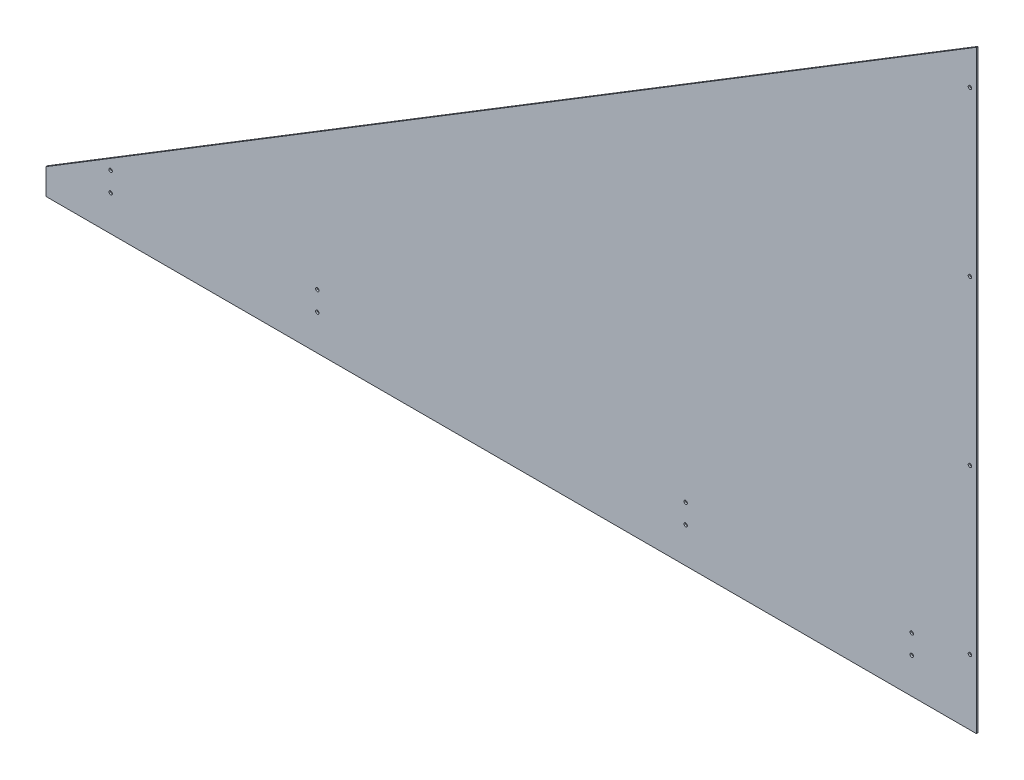
ISO-10303-21;
HEADER;
FILE_DESCRIPTION(('STEP AP214'),'2;1');
FILE_NAME('part.step','',(''),(''),'','','');
FILE_SCHEMA(('AUTOMOTIVE_DESIGN { 1 0 10303 214 1 1 1 1 }'));
ENDSEC;
DATA;
#1=APPLICATION_CONTEXT('core data for automotive mechanical design processes');
#2=APPLICATION_PROTOCOL_DEFINITION('international standard','automotive_design',2000,#1);
#3=PRODUCT_CONTEXT('',#1,'mechanical');
#4=PRODUCT('Part','Part','',(#3));
#5=PRODUCT_RELATED_PRODUCT_CATEGORY('part','',(#4));
#6=PRODUCT_DEFINITION_FORMATION('','',#4);
#7=PRODUCT_DEFINITION_CONTEXT('part definition',#1,'design');
#8=PRODUCT_DEFINITION('design','',#6,#7);
#9=PRODUCT_DEFINITION_SHAPE('','',#8);
#10=(LENGTH_UNIT() NAMED_UNIT(*) SI_UNIT(.MILLI.,.METRE.));
#11=(NAMED_UNIT(*) PLANE_ANGLE_UNIT() SI_UNIT($,.RADIAN.));
#12=(NAMED_UNIT(*) SI_UNIT($,.STERADIAN.) SOLID_ANGLE_UNIT());
#13=UNCERTAINTY_MEASURE_WITH_UNIT(LENGTH_MEASURE(1.E-05),#10,'distance_accuracy_value','');
#14=(GEOMETRIC_REPRESENTATION_CONTEXT(3) GLOBAL_UNCERTAINTY_ASSIGNED_CONTEXT((#13)) GLOBAL_UNIT_ASSIGNED_CONTEXT((#10,
#11,#12)) REPRESENTATION_CONTEXT('',''));
#15=CARTESIAN_POINT('',(0.,0.,0.));
#16=DIRECTION('',(0.,0.,1.));
#17=DIRECTION('',(1.,0.,0.));
#18=AXIS2_PLACEMENT_3D('',#15,#16,#17);
#19=CARTESIAN_POINT('',(0.,0.,3.175));
#20=DIRECTION('',(0.,0.,1.));
#21=DIRECTION('',(1.,0.,0.));
#22=AXIS2_PLACEMENT_3D('',#19,#20,#21);
#23=PLANE('',#22);
#24=CARTESIAN_POINT('',(1816.1,77.7875,3.175));
#25=DIRECTION('',(0.,0.,-1.));
#26=DIRECTION('',(-1.,0.,0.));
#27=AXIS2_PLACEMENT_3D('',#24,#25,#26);
#28=CIRCLE('',#27,3.3782);
#29=CARTESIAN_POINT('',(1812.7218,77.7875,3.175));
#30=VERTEX_POINT('',#29);
#31=EDGE_CURVE('E100',#30,#30,#28,.T.);
#32=ORIENTED_EDGE('',*,*,#31,.T.);
#33=EDGE_LOOP('',(#32));
#34=FACE_BOUND('',#33,.T.);
#35=CARTESIAN_POINT('',(1816.1,399.520833333333,3.175));
#36=DIRECTION('',(0.,0.,-1.));
#37=DIRECTION('',(-1.,0.,0.));
#38=AXIS2_PLACEMENT_3D('',#35,#36,#37);
#39=CIRCLE('',#38,3.3782);
#40=CARTESIAN_POINT('',(1812.7218,399.520833333333,3.175));
#41=VERTEX_POINT('',#40);
#42=EDGE_CURVE('E106',#41,#41,#39,.T.);
#43=ORIENTED_EDGE('',*,*,#42,.T.);
#44=EDGE_LOOP('',(#43));
#45=FACE_BOUND('',#44,.T.);
#46=CARTESIAN_POINT('',(1816.1,721.254166666667,3.175));
#47=DIRECTION('',(0.,0.,-1.));
#48=DIRECTION('',(-1.,0.,0.));
#49=AXIS2_PLACEMENT_3D('',#46,#47,#48);
#50=CIRCLE('',#49,3.3782);
#51=CARTESIAN_POINT('',(1812.7218,721.254166666667,3.175));
#52=VERTEX_POINT('',#51);
#53=EDGE_CURVE('E112',#52,#52,#50,.T.);
#54=ORIENTED_EDGE('',*,*,#53,.T.);
#55=EDGE_LOOP('',(#54));
#56=FACE_BOUND('',#55,.T.);
#57=CARTESIAN_POINT('',(1816.1,1042.9875,3.175));
#58=DIRECTION('',(0.,0.,-1.));
#59=DIRECTION('',(-1.,0.,0.));
#60=AXIS2_PLACEMENT_3D('',#57,#58,#59);
#61=CIRCLE('',#60,3.3782);
#62=CARTESIAN_POINT('',(1812.7218,1042.9875,3.175));
#63=VERTEX_POINT('',#62);
#64=EDGE_CURVE('E118',#63,#63,#61,.T.);
#65=ORIENTED_EDGE('',*,*,#64,.T.);
#66=EDGE_LOOP('',(#65));
#67=FACE_BOUND('',#66,.T.);
#68=CARTESIAN_POINT('',(1701.8,19.05,3.175));
#69=DIRECTION('',(0.,0.,-1.));
#70=DIRECTION('',(-1.,0.,0.));
#71=AXIS2_PLACEMENT_3D('',#68,#69,#70);
#72=CIRCLE('',#71,3.3782);
#73=CARTESIAN_POINT('',(1698.4218,19.05,3.175));
#74=VERTEX_POINT('',#73);
#75=EDGE_CURVE('E124',#74,#74,#72,.T.);
#76=ORIENTED_EDGE('',*,*,#75,.T.);
#77=EDGE_LOOP('',(#76));
#78=FACE_BOUND('',#77,.T.);
#79=CARTESIAN_POINT('',(1701.8,57.15,3.175));
#80=DIRECTION('',(0.,0.,-1.));
#81=DIRECTION('',(-1.,0.,0.));
#82=AXIS2_PLACEMENT_3D('',#79,#80,#81);
#83=CIRCLE('',#82,3.3782);
#84=CARTESIAN_POINT('',(1698.4218,57.15,3.175));
#85=VERTEX_POINT('',#84);
#86=EDGE_CURVE('E130',#85,#85,#83,.T.);
#87=ORIENTED_EDGE('',*,*,#86,.T.);
#88=EDGE_LOOP('',(#87));
#89=FACE_BOUND('',#88,.T.);
#90=DIRECTION('',(-0.853281833651959,-0.521450009453975,0.));
#91=VECTOR('',#90,1.);
#92=CARTESIAN_POINT('',(0.,0.,3.175));
#93=LINE('',#92,#91);
#94=CARTESIAN_POINT('',(1828.8,1117.6,3.175));
#95=VERTEX_POINT('',#94);
#96=CARTESIAN_POINT('',(0.,0.,3.175));
#97=VERTEX_POINT('',#96);
#98=EDGE_CURVE('E51',#95,#97,#93,.T.);
#99=ORIENTED_EDGE('',*,*,#98,.T.);
#100=DIRECTION('',(0.,1.,0.));
#101=VECTOR('',#100,1.);
#102=CARTESIAN_POINT('',(0.,0.,3.17499999999993));
#103=LINE('',#102,#101);
#104=CARTESIAN_POINT('',(0.,-50.8,3.17500000000037));
#105=VERTEX_POINT('',#104);
#106=EDGE_CURVE('E70',#105,#97,#103,.T.);
#107=ORIENTED_EDGE('',*,*,#106,.F.);
#108=DIRECTION('',(-1.,0.,0.));
#109=VECTOR('',#108,1.);
#110=CARTESIAN_POINT('',(1828.8,-50.8,3.17499999999993));
#111=LINE('',#110,#109);
#112=CARTESIAN_POINT('',(1828.8,-50.8,3.17499999999993));
#113=VERTEX_POINT('',#112);
#114=EDGE_CURVE('E74',#113,#105,#111,.T.);
#115=ORIENTED_EDGE('',*,*,#114,.F.);
#116=DIRECTION('',(0.,1.,0.));
#117=VECTOR('',#116,1.);
#118=CARTESIAN_POINT('',(1828.8,1117.6,3.175));
#119=LINE('',#118,#117);
#120=EDGE_CURVE('E170',#113,#95,#119,.T.);
#121=ORIENTED_EDGE('',*,*,#120,.T.);
#122=EDGE_LOOP('',(#99,#107,#115,#121));
#123=FACE_BOUND('',#122,.T.);
#124=CARTESIAN_POINT('',(127.,19.05,3.175));
#125=DIRECTION('',(0.,0.,-1.));
#126=DIRECTION('',(-1.,0.,0.));
#127=AXIS2_PLACEMENT_3D('',#124,#125,#126);
#128=CIRCLE('',#127,3.3782);
#129=CARTESIAN_POINT('',(123.6218,19.05,3.175));
#130=VERTEX_POINT('',#129);
#131=EDGE_CURVE('E166',#130,#130,#128,.T.);
#132=ORIENTED_EDGE('',*,*,#131,.T.);
#133=EDGE_LOOP('',(#132));
#134=FACE_BOUND('',#133,.T.);
#135=CARTESIAN_POINT('',(127.,57.15,3.175));
#136=DIRECTION('',(0.,0.,-1.));
#137=DIRECTION('',(-1.,0.,0.));
#138=AXIS2_PLACEMENT_3D('',#135,#136,#137);
#139=CIRCLE('',#138,3.3782);
#140=CARTESIAN_POINT('',(123.6218,57.15,3.175));
#141=VERTEX_POINT('',#140);
#142=EDGE_CURVE('E160',#141,#141,#139,.T.);
#143=ORIENTED_EDGE('',*,*,#142,.T.);
#144=EDGE_LOOP('',(#143));
#145=FACE_BOUND('',#144,.T.);
#146=CARTESIAN_POINT('',(533.4,19.05,3.175));
#147=DIRECTION('',(0.,0.,-1.));
#148=DIRECTION('',(-1.,0.,0.));
#149=AXIS2_PLACEMENT_3D('',#146,#147,#148);
#150=CIRCLE('',#149,3.3782);
#151=CARTESIAN_POINT('',(530.0218,19.05,3.175));
#152=VERTEX_POINT('',#151);
#153=EDGE_CURVE('E154',#152,#152,#150,.T.);
#154=ORIENTED_EDGE('',*,*,#153,.T.);
#155=EDGE_LOOP('',(#154));
#156=FACE_BOUND('',#155,.T.);
#157=CARTESIAN_POINT('',(533.4,57.15,3.175));
#158=DIRECTION('',(0.,0.,-1.));
#159=DIRECTION('',(-1.,0.,0.));
#160=AXIS2_PLACEMENT_3D('',#157,#158,#159);
#161=CIRCLE('',#160,3.3782);
#162=CARTESIAN_POINT('',(530.0218,57.15,3.175));
#163=VERTEX_POINT('',#162);
#164=EDGE_CURVE('E148',#163,#163,#161,.T.);
#165=ORIENTED_EDGE('',*,*,#164,.T.);
#166=EDGE_LOOP('',(#165));
#167=FACE_BOUND('',#166,.T.);
#168=CARTESIAN_POINT('',(1257.3,19.05,3.175));
#169=DIRECTION('',(0.,0.,-1.));
#170=DIRECTION('',(-1.,0.,0.));
#171=AXIS2_PLACEMENT_3D('',#168,#169,#170);
#172=CIRCLE('',#171,3.3782);
#173=CARTESIAN_POINT('',(1253.9218,19.05,3.175));
#174=VERTEX_POINT('',#173);
#175=EDGE_CURVE('E142',#174,#174,#172,.T.);
#176=ORIENTED_EDGE('',*,*,#175,.T.);
#177=EDGE_LOOP('',(#176));
#178=FACE_BOUND('',#177,.T.);
#179=CARTESIAN_POINT('',(1257.3,57.15,3.175));
#180=DIRECTION('',(0.,0.,-1.));
#181=DIRECTION('',(-1.,0.,0.));
#182=AXIS2_PLACEMENT_3D('',#179,#180,#181);
#183=CIRCLE('',#182,3.3782);
#184=CARTESIAN_POINT('',(1253.9218,57.15,3.175));
#185=VERTEX_POINT('',#184);
#186=EDGE_CURVE('E136',#185,#185,#183,.T.);
#187=ORIENTED_EDGE('',*,*,#186,.T.);
#188=EDGE_LOOP('',(#187));
#189=FACE_BOUND('',#188,.T.);
#190=ADVANCED_FACE('F35',(#34,#45,#56,#67,#78,#89,#123,#134,#145,#156,#167,#178,#189),#23,.T.);
#191=CARTESIAN_POINT('',(0.,0.,0.));
#192=DIRECTION('',(0.,0.,1.));
#193=DIRECTION('',(1.,0.,0.));
#194=AXIS2_PLACEMENT_3D('',#191,#192,#193);
#195=PLANE('',#194);
#196=CARTESIAN_POINT('',(1816.1,77.7875,0.));
#197=DIRECTION('',(0.,0.,-1.));
#198=DIRECTION('',(-1.,0.,0.));
#199=AXIS2_PLACEMENT_3D('',#196,#197,#198);
#200=CIRCLE('',#199,3.3782);
#201=CARTESIAN_POINT('',(1812.7218,77.7875,0.));
#202=VERTEX_POINT('',#201);
#203=EDGE_CURVE('E97',#202,#202,#200,.T.);
#204=ORIENTED_EDGE('',*,*,#203,.F.);
#205=EDGE_LOOP('',(#204));
#206=FACE_BOUND('',#205,.T.);
#207=CARTESIAN_POINT('',(1816.1,399.520833333333,0.));
#208=DIRECTION('',(0.,0.,-1.));
#209=DIRECTION('',(-1.,0.,0.));
#210=AXIS2_PLACEMENT_3D('',#207,#208,#209);
#211=CIRCLE('',#210,3.3782);
#212=CARTESIAN_POINT('',(1812.7218,399.520833333333,0.));
#213=VERTEX_POINT('',#212);
#214=EDGE_CURVE('E103',#213,#213,#211,.T.);
#215=ORIENTED_EDGE('',*,*,#214,.F.);
#216=EDGE_LOOP('',(#215));
#217=FACE_BOUND('',#216,.T.);
#218=CARTESIAN_POINT('',(1816.1,721.254166666667,0.));
#219=DIRECTION('',(0.,0.,-1.));
#220=DIRECTION('',(-1.,0.,0.));
#221=AXIS2_PLACEMENT_3D('',#218,#219,#220);
#222=CIRCLE('',#221,3.3782);
#223=CARTESIAN_POINT('',(1812.7218,721.254166666667,0.));
#224=VERTEX_POINT('',#223);
#225=EDGE_CURVE('E109',#224,#224,#222,.T.);
#226=ORIENTED_EDGE('',*,*,#225,.F.);
#227=EDGE_LOOP('',(#226));
#228=FACE_BOUND('',#227,.T.);
#229=CARTESIAN_POINT('',(1816.1,1042.9875,0.));
#230=DIRECTION('',(0.,0.,-1.));
#231=DIRECTION('',(-1.,0.,0.));
#232=AXIS2_PLACEMENT_3D('',#229,#230,#231);
#233=CIRCLE('',#232,3.3782);
#234=CARTESIAN_POINT('',(1812.7218,1042.9875,0.));
#235=VERTEX_POINT('',#234);
#236=EDGE_CURVE('E115',#235,#235,#233,.T.);
#237=ORIENTED_EDGE('',*,*,#236,.F.);
#238=EDGE_LOOP('',(#237));
#239=FACE_BOUND('',#238,.T.);
#240=CARTESIAN_POINT('',(1701.8,19.05,0.));
#241=DIRECTION('',(0.,0.,-1.));
#242=DIRECTION('',(-1.,0.,0.));
#243=AXIS2_PLACEMENT_3D('',#240,#241,#242);
#244=CIRCLE('',#243,3.3782);
#245=CARTESIAN_POINT('',(1698.4218,19.05,0.));
#246=VERTEX_POINT('',#245);
#247=EDGE_CURVE('E121',#246,#246,#244,.T.);
#248=ORIENTED_EDGE('',*,*,#247,.F.);
#249=EDGE_LOOP('',(#248));
#250=FACE_BOUND('',#249,.T.);
#251=CARTESIAN_POINT('',(1701.8,57.15,0.));
#252=DIRECTION('',(0.,0.,-1.));
#253=DIRECTION('',(-1.,0.,0.));
#254=AXIS2_PLACEMENT_3D('',#251,#252,#253);
#255=CIRCLE('',#254,3.3782);
#256=CARTESIAN_POINT('',(1698.4218,57.15,0.));
#257=VERTEX_POINT('',#256);
#258=EDGE_CURVE('E127',#257,#257,#255,.T.);
#259=ORIENTED_EDGE('',*,*,#258,.F.);
#260=EDGE_LOOP('',(#259));
#261=FACE_BOUND('',#260,.T.);
#262=CARTESIAN_POINT('',(1257.3,57.15,0.));
#263=DIRECTION('',(0.,0.,-1.));
#264=DIRECTION('',(-1.,0.,0.));
#265=AXIS2_PLACEMENT_3D('',#262,#263,#264);
#266=CIRCLE('',#265,3.3782);
#267=CARTESIAN_POINT('',(1253.9218,57.15,0.));
#268=VERTEX_POINT('',#267);
#269=EDGE_CURVE('E133',#268,#268,#266,.T.);
#270=ORIENTED_EDGE('',*,*,#269,.F.);
#271=EDGE_LOOP('',(#270));
#272=FACE_BOUND('',#271,.T.);
#273=CARTESIAN_POINT('',(1257.3,19.05,0.));
#274=DIRECTION('',(0.,0.,-1.));
#275=DIRECTION('',(-1.,0.,0.));
#276=AXIS2_PLACEMENT_3D('',#273,#274,#275);
#277=CIRCLE('',#276,3.3782);
#278=CARTESIAN_POINT('',(1253.9218,19.05,0.));
#279=VERTEX_POINT('',#278);
#280=EDGE_CURVE('E139',#279,#279,#277,.T.);
#281=ORIENTED_EDGE('',*,*,#280,.F.);
#282=EDGE_LOOP('',(#281));
#283=FACE_BOUND('',#282,.T.);
#284=CARTESIAN_POINT('',(533.4,57.15,0.));
#285=DIRECTION('',(0.,0.,-1.));
#286=DIRECTION('',(-1.,0.,0.));
#287=AXIS2_PLACEMENT_3D('',#284,#285,#286);
#288=CIRCLE('',#287,3.3782);
#289=CARTESIAN_POINT('',(530.0218,57.15,0.));
#290=VERTEX_POINT('',#289);
#291=EDGE_CURVE('E145',#290,#290,#288,.T.);
#292=ORIENTED_EDGE('',*,*,#291,.F.);
#293=EDGE_LOOP('',(#292));
#294=FACE_BOUND('',#293,.T.);
#295=CARTESIAN_POINT('',(533.4,19.05,0.));
#296=DIRECTION('',(0.,0.,-1.));
#297=DIRECTION('',(-1.,0.,0.));
#298=AXIS2_PLACEMENT_3D('',#295,#296,#297);
#299=CIRCLE('',#298,3.3782);
#300=CARTESIAN_POINT('',(530.0218,19.05,0.));
#301=VERTEX_POINT('',#300);
#302=EDGE_CURVE('E151',#301,#301,#299,.T.);
#303=ORIENTED_EDGE('',*,*,#302,.F.);
#304=EDGE_LOOP('',(#303));
#305=FACE_BOUND('',#304,.T.);
#306=CARTESIAN_POINT('',(127.,19.05,0.));
#307=DIRECTION('',(0.,0.,-1.));
#308=DIRECTION('',(-1.,0.,0.));
#309=AXIS2_PLACEMENT_3D('',#306,#307,#308);
#310=CIRCLE('',#309,3.3782);
#311=CARTESIAN_POINT('',(123.6218,19.05,0.));
#312=VERTEX_POINT('',#311);
#313=EDGE_CURVE('E163',#312,#312,#310,.T.);
#314=ORIENTED_EDGE('',*,*,#313,.F.);
#315=EDGE_LOOP('',(#314));
#316=FACE_BOUND('',#315,.T.);
#317=DIRECTION('',(0.,1.,0.));
#318=VECTOR('',#317,1.);
#319=CARTESIAN_POINT('',(1828.8,1117.6,0.));
#320=LINE('',#319,#318);
#321=CARTESIAN_POINT('',(1828.8,-50.8,0.));
#322=VERTEX_POINT('',#321);
#323=CARTESIAN_POINT('',(1828.8,1117.6,0.));
#324=VERTEX_POINT('',#323);
#325=EDGE_CURVE('E169',#322,#324,#320,.T.);
#326=ORIENTED_EDGE('',*,*,#325,.F.);
#327=DIRECTION('',(-1.,0.,0.));
#328=VECTOR('',#327,1.);
#329=CARTESIAN_POINT('',(1828.8,-50.8,0.));
#330=LINE('',#329,#328);
#331=CARTESIAN_POINT('',(0.,-50.8,0.));
#332=VERTEX_POINT('',#331);
#333=EDGE_CURVE('E92',#322,#332,#330,.T.);
#334=ORIENTED_EDGE('',*,*,#333,.T.);
#335=DIRECTION('',(0.,1.,0.));
#336=VECTOR('',#335,1.);
#337=CARTESIAN_POINT('',(0.,0.,0.));
#338=LINE('',#337,#336);
#339=CARTESIAN_POINT('',(0.,0.,0.));
#340=VERTEX_POINT('',#339);
#341=EDGE_CURVE('E84',#332,#340,#338,.T.);
#342=ORIENTED_EDGE('',*,*,#341,.T.);
#343=DIRECTION('',(-0.853281833651959,-0.521450009453975,0.));
#344=VECTOR('',#343,1.);
#345=CARTESIAN_POINT('',(0.,0.,0.));
#346=LINE('',#345,#344);
#347=EDGE_CURVE('E172',#324,#340,#346,.T.);
#348=ORIENTED_EDGE('',*,*,#347,.F.);
#349=EDGE_LOOP('',(#326,#334,#342,#348));
#350=FACE_BOUND('',#349,.T.);
#351=CARTESIAN_POINT('',(127.,57.15,0.));
#352=DIRECTION('',(0.,0.,-1.));
#353=DIRECTION('',(-1.,0.,0.));
#354=AXIS2_PLACEMENT_3D('',#351,#352,#353);
#355=CIRCLE('',#354,3.3782);
#356=CARTESIAN_POINT('',(123.6218,57.15,0.));
#357=VERTEX_POINT('',#356);
#358=EDGE_CURVE('E157',#357,#357,#355,.T.);
#359=ORIENTED_EDGE('',*,*,#358,.F.);
#360=EDGE_LOOP('',(#359));
#361=FACE_BOUND('',#360,.T.);
#362=ADVANCED_FACE('F179',(#206,#217,#228,#239,#250,#261,#272,#283,#294,#305,#316,#350,#361),
#195,.F.);
#363=CARTESIAN_POINT('',(1828.8,1117.6,3.175));
#364=DIRECTION('',(-1.,0.,0.));
#365=DIRECTION('',(0.,-1.,0.));
#366=AXIS2_PLACEMENT_3D('',#363,#364,#365);
#367=PLANE('',#366);
#368=ORIENTED_EDGE('',*,*,#325,.T.);
#369=DIRECTION('',(0.,0.,-1.));
#370=VECTOR('',#369,1.);
#371=CARTESIAN_POINT('',(1828.8,1117.6,3.175));
#372=LINE('',#371,#370);
#373=EDGE_CURVE('E11',#95,#324,#372,.T.);
#374=ORIENTED_EDGE('',*,*,#373,.F.);
#375=ORIENTED_EDGE('',*,*,#120,.F.);
#376=DIRECTION('',(0.,0.,-1.));
#377=VECTOR('',#376,1.);
#378=CARTESIAN_POINT('',(1828.8,-50.8,1832.6804195055));
#379=LINE('',#378,#377);
#380=EDGE_CURVE('E78',#113,#322,#379,.T.);
#381=ORIENTED_EDGE('',*,*,#380,.T.);
#382=EDGE_LOOP('',(#368,#374,#375,#381));
#383=FACE_BOUND('',#382,.T.);
#384=ADVANCED_FACE('F37',(#383),#367,.F.);
#385=CARTESIAN_POINT('',(0.,0.,3.175));
#386=DIRECTION('',(0.521450009453975,-0.853281833651959,0.));
#387=DIRECTION('',(0.853281833651959,0.521450009453975,0.));
#388=AXIS2_PLACEMENT_3D('',#385,#386,#387);
#389=PLANE('',#388);
#390=ORIENTED_EDGE('',*,*,#347,.T.);
#391=DIRECTION('',(0.,0.,-1.));
#392=VECTOR('',#391,1.);
#393=CARTESIAN_POINT('',(0.,0.,3.175));
#394=LINE('',#393,#392);
#395=EDGE_CURVE('E44',#97,#340,#394,.T.);
#396=ORIENTED_EDGE('',*,*,#395,.F.);
#397=ORIENTED_EDGE('',*,*,#98,.F.);
#398=ORIENTED_EDGE('',*,*,#373,.T.);
#399=EDGE_LOOP('',(#390,#396,#397,#398));
#400=FACE_BOUND('',#399,.T.);
#401=ADVANCED_FACE('F183',(#400),#389,.F.);
#402=CARTESIAN_POINT('',(127.,19.05,0.));
#403=DIRECTION('',(0.,0.,-1.));
#404=DIRECTION('',(-1.,0.,0.));
#405=AXIS2_PLACEMENT_3D('',#402,#403,#404);
#406=CYLINDRICAL_SURFACE('',#405,3.3782);
#407=ORIENTED_EDGE('',*,*,#131,.F.);
#408=EDGE_LOOP('',(#407));
#409=FACE_BOUND('',#408,.T.);
#410=ORIENTED_EDGE('',*,*,#313,.T.);
#411=EDGE_LOOP('',(#410));
#412=FACE_BOUND('',#411,.T.);
#413=ADVANCED_FACE('F185',(#409,#412),#406,.F.);
#414=CARTESIAN_POINT('',(127.,57.15,0.));
#415=DIRECTION('',(0.,0.,-1.));
#416=DIRECTION('',(-1.,0.,0.));
#417=AXIS2_PLACEMENT_3D('',#414,#415,#416);
#418=CYLINDRICAL_SURFACE('',#417,3.3782);
#419=ORIENTED_EDGE('',*,*,#142,.F.);
#420=EDGE_LOOP('',(#419));
#421=FACE_BOUND('',#420,.T.);
#422=ORIENTED_EDGE('',*,*,#358,.T.);
#423=EDGE_LOOP('',(#422));
#424=FACE_BOUND('',#423,.T.);
#425=ADVANCED_FACE('F190',(#421,#424),#418,.F.);
#426=CARTESIAN_POINT('',(533.4,19.05,0.));
#427=DIRECTION('',(0.,0.,-1.));
#428=DIRECTION('',(-1.,0.,0.));
#429=AXIS2_PLACEMENT_3D('',#426,#427,#428);
#430=CYLINDRICAL_SURFACE('',#429,3.3782);
#431=ORIENTED_EDGE('',*,*,#153,.F.);
#432=EDGE_LOOP('',(#431));
#433=FACE_BOUND('',#432,.T.);
#434=ORIENTED_EDGE('',*,*,#302,.T.);
#435=EDGE_LOOP('',(#434));
#436=FACE_BOUND('',#435,.T.);
#437=ADVANCED_FACE('F205',(#433,#436),#430,.F.);
#438=CARTESIAN_POINT('',(533.4,57.15,0.));
#439=DIRECTION('',(0.,0.,-1.));
#440=DIRECTION('',(-1.,0.,0.));
#441=AXIS2_PLACEMENT_3D('',#438,#439,#440);
#442=CYLINDRICAL_SURFACE('',#441,3.3782);
#443=ORIENTED_EDGE('',*,*,#164,.F.);
#444=EDGE_LOOP('',(#443));
#445=FACE_BOUND('',#444,.T.);
#446=ORIENTED_EDGE('',*,*,#291,.T.);
#447=EDGE_LOOP('',(#446));
#448=FACE_BOUND('',#447,.T.);
#449=ADVANCED_FACE('F209',(#445,#448),#442,.F.);
#450=CARTESIAN_POINT('',(1257.3,19.05,0.));
#451=DIRECTION('',(0.,0.,-1.));
#452=DIRECTION('',(-1.,0.,0.));
#453=AXIS2_PLACEMENT_3D('',#450,#451,#452);
#454=CYLINDRICAL_SURFACE('',#453,3.3782);
#455=ORIENTED_EDGE('',*,*,#175,.F.);
#456=EDGE_LOOP('',(#455));
#457=FACE_BOUND('',#456,.T.);
#458=ORIENTED_EDGE('',*,*,#280,.T.);
#459=EDGE_LOOP('',(#458));
#460=FACE_BOUND('',#459,.T.);
#461=ADVANCED_FACE('F213',(#457,#460),#454,.F.);
#462=CARTESIAN_POINT('',(1257.3,57.15,0.));
#463=DIRECTION('',(0.,0.,-1.));
#464=DIRECTION('',(-1.,0.,0.));
#465=AXIS2_PLACEMENT_3D('',#462,#463,#464);
#466=CYLINDRICAL_SURFACE('',#465,3.3782);
#467=ORIENTED_EDGE('',*,*,#186,.F.);
#468=EDGE_LOOP('',(#467));
#469=FACE_BOUND('',#468,.T.);
#470=ORIENTED_EDGE('',*,*,#269,.T.);
#471=EDGE_LOOP('',(#470));
#472=FACE_BOUND('',#471,.T.);
#473=ADVANCED_FACE('F217',(#469,#472),#466,.F.);
#474=CARTESIAN_POINT('',(1701.8,57.15,0.));
#475=DIRECTION('',(0.,0.,-1.));
#476=DIRECTION('',(-1.,0.,0.));
#477=AXIS2_PLACEMENT_3D('',#474,#475,#476);
#478=CYLINDRICAL_SURFACE('',#477,3.3782);
#479=ORIENTED_EDGE('',*,*,#86,.F.);
#480=EDGE_LOOP('',(#479));
#481=FACE_BOUND('',#480,.T.);
#482=ORIENTED_EDGE('',*,*,#258,.T.);
#483=EDGE_LOOP('',(#482));
#484=FACE_BOUND('',#483,.T.);
#485=ADVANCED_FACE('F221',(#481,#484),#478,.F.);
#486=CARTESIAN_POINT('',(1701.8,19.05,0.));
#487=DIRECTION('',(0.,0.,-1.));
#488=DIRECTION('',(-1.,0.,0.));
#489=AXIS2_PLACEMENT_3D('',#486,#487,#488);
#490=CYLINDRICAL_SURFACE('',#489,3.3782);
#491=ORIENTED_EDGE('',*,*,#75,.F.);
#492=EDGE_LOOP('',(#491));
#493=FACE_BOUND('',#492,.T.);
#494=ORIENTED_EDGE('',*,*,#247,.T.);
#495=EDGE_LOOP('',(#494));
#496=FACE_BOUND('',#495,.T.);
#497=ADVANCED_FACE('F225',(#493,#496),#490,.F.);
#498=CARTESIAN_POINT('',(1816.1,1042.9875,0.));
#499=DIRECTION('',(0.,0.,-1.));
#500=DIRECTION('',(-1.,0.,0.));
#501=AXIS2_PLACEMENT_3D('',#498,#499,#500);
#502=CYLINDRICAL_SURFACE('',#501,3.3782);
#503=ORIENTED_EDGE('',*,*,#64,.F.);
#504=EDGE_LOOP('',(#503));
#505=FACE_BOUND('',#504,.T.);
#506=ORIENTED_EDGE('',*,*,#236,.T.);
#507=EDGE_LOOP('',(#506));
#508=FACE_BOUND('',#507,.T.);
#509=ADVANCED_FACE('F229',(#505,#508),#502,.F.);
#510=CARTESIAN_POINT('',(1816.1,721.254166666667,0.));
#511=DIRECTION('',(0.,0.,-1.));
#512=DIRECTION('',(-1.,0.,0.));
#513=AXIS2_PLACEMENT_3D('',#510,#511,#512);
#514=CYLINDRICAL_SURFACE('',#513,3.3782);
#515=ORIENTED_EDGE('',*,*,#53,.F.);
#516=EDGE_LOOP('',(#515));
#517=FACE_BOUND('',#516,.T.);
#518=ORIENTED_EDGE('',*,*,#225,.T.);
#519=EDGE_LOOP('',(#518));
#520=FACE_BOUND('',#519,.T.);
#521=ADVANCED_FACE('F233',(#517,#520),#514,.F.);
#522=CARTESIAN_POINT('',(1816.1,399.520833333333,0.));
#523=DIRECTION('',(0.,0.,-1.));
#524=DIRECTION('',(-1.,0.,0.));
#525=AXIS2_PLACEMENT_3D('',#522,#523,#524);
#526=CYLINDRICAL_SURFACE('',#525,3.3782);
#527=ORIENTED_EDGE('',*,*,#42,.F.);
#528=EDGE_LOOP('',(#527));
#529=FACE_BOUND('',#528,.T.);
#530=ORIENTED_EDGE('',*,*,#214,.T.);
#531=EDGE_LOOP('',(#530));
#532=FACE_BOUND('',#531,.T.);
#533=ADVANCED_FACE('F237',(#529,#532),#526,.F.);
#534=CARTESIAN_POINT('',(1816.1,77.7875,0.));
#535=DIRECTION('',(0.,0.,-1.));
#536=DIRECTION('',(-1.,0.,0.));
#537=AXIS2_PLACEMENT_3D('',#534,#535,#536);
#538=CYLINDRICAL_SURFACE('',#537,3.3782);
#539=ORIENTED_EDGE('',*,*,#31,.F.);
#540=EDGE_LOOP('',(#539));
#541=FACE_BOUND('',#540,.T.);
#542=ORIENTED_EDGE('',*,*,#203,.T.);
#543=EDGE_LOOP('',(#542));
#544=FACE_BOUND('',#543,.T.);
#545=ADVANCED_FACE('F241',(#541,#544),#538,.F.);
#546=CARTESIAN_POINT('',(1828.8,-50.8,1832.6804195055));
#547=DIRECTION('',(0.,-1.,0.));
#548=DIRECTION('',(0.,0.,-1.));
#549=AXIS2_PLACEMENT_3D('',#546,#547,#548);
#550=PLANE('',#549);
#551=ORIENTED_EDGE('',*,*,#380,.F.);
#552=ORIENTED_EDGE('',*,*,#114,.T.);
#553=DIRECTION('',(0.,0.,-1.));
#554=VECTOR('',#553,1.);
#555=CARTESIAN_POINT('',(0.,-50.8,1832.6804195055));
#556=LINE('',#555,#554);
#557=EDGE_CURVE('E79',#105,#332,#556,.T.);
#558=ORIENTED_EDGE('',*,*,#557,.T.);
#559=ORIENTED_EDGE('',*,*,#333,.F.);
#560=EDGE_LOOP('',(#551,#552,#558,#559));
#561=FACE_BOUND('',#560,.T.);
#562=ADVANCED_FACE('F89',(#561),#550,.T.);
#563=CARTESIAN_POINT('',(0.,0.,1832.6804195055));
#564=DIRECTION('',(-1.,0.,0.));
#565=DIRECTION('',(0.,0.,1.));
#566=AXIS2_PLACEMENT_3D('',#563,#564,#565);
#567=PLANE('',#566);
#568=ORIENTED_EDGE('',*,*,#557,.F.);
#569=ORIENTED_EDGE('',*,*,#106,.T.);
#570=ORIENTED_EDGE('',*,*,#395,.T.);
#571=ORIENTED_EDGE('',*,*,#341,.F.);
#572=EDGE_LOOP('',(#568,#569,#570,#571));
#573=FACE_BOUND('',#572,.T.);
#574=ADVANCED_FACE('F82',(#573),#567,.T.);
#575=CLOSED_SHELL('',(#190,#362,#384,#401,#413,#425,#437,#449,#461,#473,#485,#497,#509,#521,
#533,#545,#562,#574));
#576=MANIFOLD_SOLID_BREP('B2',#575);
#577=ADVANCED_BREP_SHAPE_REPRESENTATION('',(#18,#576),#14);
#578=SHAPE_DEFINITION_REPRESENTATION(#9,#577);
ENDSEC;
END-ISO-10303-21;
